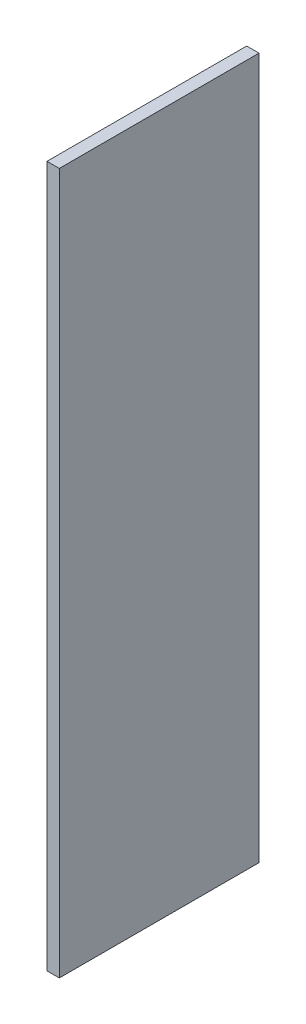
ISO-10303-21;
HEADER;
FILE_DESCRIPTION(('STEP AP214'),'2;1');
FILE_NAME('part.step','',(''),(''),'','','');
FILE_SCHEMA(('AUTOMOTIVE_DESIGN { 1 0 10303 214 1 1 1 1 }'));
ENDSEC;
DATA;
#1=APPLICATION_CONTEXT('core data for automotive mechanical design processes');
#2=APPLICATION_PROTOCOL_DEFINITION('international standard','automotive_design',2000,#1);
#3=PRODUCT_CONTEXT('',#1,'mechanical');
#4=PRODUCT('Part','Part','',(#3));
#5=PRODUCT_RELATED_PRODUCT_CATEGORY('part','',(#4));
#6=PRODUCT_DEFINITION_FORMATION('','',#4);
#7=PRODUCT_DEFINITION_CONTEXT('part definition',#1,'design');
#8=PRODUCT_DEFINITION('design','',#6,#7);
#9=PRODUCT_DEFINITION_SHAPE('','',#8);
#10=(LENGTH_UNIT() NAMED_UNIT(*) SI_UNIT(.MILLI.,.METRE.));
#11=(NAMED_UNIT(*) PLANE_ANGLE_UNIT() SI_UNIT($,.RADIAN.));
#12=(NAMED_UNIT(*) SI_UNIT($,.STERADIAN.) SOLID_ANGLE_UNIT());
#13=UNCERTAINTY_MEASURE_WITH_UNIT(LENGTH_MEASURE(1.E-05),#10,'distance_accuracy_value','');
#14=(GEOMETRIC_REPRESENTATION_CONTEXT(3) GLOBAL_UNCERTAINTY_ASSIGNED_CONTEXT((#13)) GLOBAL_UNIT_ASSIGNED_CONTEXT((#10,
#11,#12)) REPRESENTATION_CONTEXT('',''));
#15=CARTESIAN_POINT('',(0.,0.,0.));
#16=DIRECTION('',(0.,0.,1.));
#17=DIRECTION('',(1.,0.,0.));
#18=AXIS2_PLACEMENT_3D('',#15,#16,#17);
#19=CARTESIAN_POINT('',(18.,-967.219556499024,267.607933188847));
#20=DIRECTION('',(0.,0.,-1.));
#21=DIRECTION('',(-1.,0.,0.));
#22=AXIS2_PLACEMENT_3D('',#19,#20,#21);
#23=PLANE('',#22);
#24=DIRECTION('',(0.,-1.,0.));
#25=VECTOR('',#24,1.);
#26=CARTESIAN_POINT('',(0.,-967.219556499024,267.607933188847));
#27=LINE('',#26,#25);
#28=CARTESIAN_POINT('',(0.,57.7804435009756,267.607933188847));
#29=VERTEX_POINT('',#28);
#30=CARTESIAN_POINT('',(0.,-967.219556499024,267.607933188847));
#31=VERTEX_POINT('',#30);
#32=EDGE_CURVE('E96',#29,#31,#27,.T.);
#33=ORIENTED_EDGE('',*,*,#32,.T.);
#34=DIRECTION('',(-1.,0.,0.));
#35=VECTOR('',#34,1.);
#36=CARTESIAN_POINT('',(18.,-967.219556499024,267.607933188847));
#37=LINE('',#36,#35);
#38=CARTESIAN_POINT('',(18.,-967.219556499024,267.607933188847));
#39=VERTEX_POINT('',#38);
#40=EDGE_CURVE('E11',#39,#31,#37,.T.);
#41=ORIENTED_EDGE('',*,*,#40,.F.);
#42=DIRECTION('',(0.,-1.,0.));
#43=VECTOR('',#42,1.);
#44=CARTESIAN_POINT('',(18.,-967.219556499024,267.607933188847));
#45=LINE('',#44,#43);
#46=CARTESIAN_POINT('',(18.,57.7804435009756,267.607933188847));
#47=VERTEX_POINT('',#46);
#48=EDGE_CURVE('E84',#47,#39,#45,.T.);
#49=ORIENTED_EDGE('',*,*,#48,.F.);
#50=DIRECTION('',(-1.,0.,0.));
#51=VECTOR('',#50,1.);
#52=CARTESIAN_POINT('',(18.,57.7804435009756,267.607933188847));
#53=LINE('',#52,#51);
#54=EDGE_CURVE('E92',#47,#29,#53,.T.);
#55=ORIENTED_EDGE('',*,*,#54,.T.);
#56=EDGE_LOOP('',(#33,#41,#49,#55));
#57=FACE_BOUND('',#56,.T.);
#58=ADVANCED_FACE('F33',(#57),#23,.F.);
#59=CARTESIAN_POINT('',(18.,-967.219556499024,-24.392066811153));
#60=DIRECTION('',(0.,1.,0.));
#61=DIRECTION('',(0.,0.,1.));
#62=AXIS2_PLACEMENT_3D('',#59,#60,#61);
#63=PLANE('',#62);
#64=DIRECTION('',(0.,0.,-1.));
#65=VECTOR('',#64,1.);
#66=CARTESIAN_POINT('',(0.,-967.219556499024,-24.392066811153));
#67=LINE('',#66,#65);
#68=CARTESIAN_POINT('',(0.,-967.219556499024,-24.392066811153));
#69=VERTEX_POINT('',#68);
#70=EDGE_CURVE('E88',#31,#69,#67,.T.);
#71=ORIENTED_EDGE('',*,*,#70,.T.);
#72=DIRECTION('',(-1.,0.,0.));
#73=VECTOR('',#72,1.);
#74=CARTESIAN_POINT('',(18.,-967.219556499024,-24.392066811153));
#75=LINE('',#74,#73);
#76=CARTESIAN_POINT('',(18.,-967.219556499024,-24.392066811153));
#77=VERTEX_POINT('',#76);
#78=EDGE_CURVE('E41',#77,#69,#75,.T.);
#79=ORIENTED_EDGE('',*,*,#78,.F.);
#80=DIRECTION('',(0.,0.,-1.));
#81=VECTOR('',#80,1.);
#82=CARTESIAN_POINT('',(18.,-967.219556499024,-24.392066811153));
#83=LINE('',#82,#81);
#84=EDGE_CURVE('E79',#39,#77,#83,.T.);
#85=ORIENTED_EDGE('',*,*,#84,.F.);
#86=ORIENTED_EDGE('',*,*,#40,.T.);
#87=EDGE_LOOP('',(#71,#79,#85,#86));
#88=FACE_BOUND('',#87,.T.);
#89=ADVANCED_FACE('F87',(#88),#63,.F.);
#90=CARTESIAN_POINT('',(18.,-967.219556499024,-24.392066811153));
#91=DIRECTION('',(0.,0.,1.));
#92=DIRECTION('',(1.,0.,0.));
#93=AXIS2_PLACEMENT_3D('',#90,#91,#92);
#94=PLANE('',#93);
#95=DIRECTION('',(0.,1.,0.));
#96=VECTOR('',#95,1.);
#97=CARTESIAN_POINT('',(0.,-967.219556499024,-24.392066811153));
#98=LINE('',#97,#96);
#99=CARTESIAN_POINT('',(0.,57.7804435009756,-24.392066811153));
#100=VERTEX_POINT('',#99);
#101=EDGE_CURVE('E66',#69,#100,#98,.T.);
#102=ORIENTED_EDGE('',*,*,#101,.T.);
#103=DIRECTION('',(-1.,0.,0.));
#104=VECTOR('',#103,1.);
#105=CARTESIAN_POINT('',(18.,57.7804435009756,-24.392066811153));
#106=LINE('',#105,#104);
#107=CARTESIAN_POINT('',(18.,57.7804435009756,-24.392066811153));
#108=VERTEX_POINT('',#107);
#109=EDGE_CURVE('E89',#108,#100,#106,.T.);
#110=ORIENTED_EDGE('',*,*,#109,.F.);
#111=DIRECTION('',(0.,1.,0.));
#112=VECTOR('',#111,1.);
#113=CARTESIAN_POINT('',(18.,-967.219556499024,-24.392066811153));
#114=LINE('',#113,#112);
#115=EDGE_CURVE('E82',#77,#108,#114,.T.);
#116=ORIENTED_EDGE('',*,*,#115,.F.);
#117=ORIENTED_EDGE('',*,*,#78,.T.);
#118=EDGE_LOOP('',(#102,#110,#116,#117));
#119=FACE_BOUND('',#118,.T.);
#120=ADVANCED_FACE('F90',(#119),#94,.F.);
#121=CARTESIAN_POINT('',(18.,57.7804435009756,-24.392066811153));
#122=DIRECTION('',(0.,-1.,0.));
#123=DIRECTION('',(0.,0.,-1.));
#124=AXIS2_PLACEMENT_3D('',#121,#122,#123);
#125=PLANE('',#124);
#126=DIRECTION('',(0.,0.,1.));
#127=VECTOR('',#126,1.);
#128=CARTESIAN_POINT('',(0.,57.7804435009756,-24.392066811153));
#129=LINE('',#128,#127);
#130=EDGE_CURVE('E72',#100,#29,#129,.T.);
#131=ORIENTED_EDGE('',*,*,#130,.T.);
#132=ORIENTED_EDGE('',*,*,#54,.F.);
#133=DIRECTION('',(0.,0.,1.));
#134=VECTOR('',#133,1.);
#135=CARTESIAN_POINT('',(18.,57.7804435009756,-24.392066811153));
#136=LINE('',#135,#134);
#137=EDGE_CURVE('E49',#108,#47,#136,.T.);
#138=ORIENTED_EDGE('',*,*,#137,.F.);
#139=ORIENTED_EDGE('',*,*,#109,.T.);
#140=EDGE_LOOP('',(#131,#132,#138,#139));
#141=FACE_BOUND('',#140,.T.);
#142=ADVANCED_FACE('F103',(#141),#125,.F.);
#143=CARTESIAN_POINT('',(18.,0.,0.));
#144=DIRECTION('',(1.,0.,0.));
#145=DIRECTION('',(0.,0.,-1.));
#146=AXIS2_PLACEMENT_3D('',#143,#144,#145);
#147=PLANE('',#146);
#148=ORIENTED_EDGE('',*,*,#48,.T.);
#149=ORIENTED_EDGE('',*,*,#84,.T.);
#150=ORIENTED_EDGE('',*,*,#115,.T.);
#151=ORIENTED_EDGE('',*,*,#137,.T.);
#152=EDGE_LOOP('',(#148,#149,#150,#151));
#153=FACE_BOUND('',#152,.T.);
#154=ADVANCED_FACE('F80',(#153),#147,.T.);
#155=CARTESIAN_POINT('',(0.,0.,0.));
#156=DIRECTION('',(1.,0.,0.));
#157=DIRECTION('',(0.,0.,-1.));
#158=AXIS2_PLACEMENT_3D('',#155,#156,#157);
#159=PLANE('',#158);
#160=ORIENTED_EDGE('',*,*,#32,.F.);
#161=ORIENTED_EDGE('',*,*,#130,.F.);
#162=ORIENTED_EDGE('',*,*,#101,.F.);
#163=ORIENTED_EDGE('',*,*,#70,.F.);
#164=EDGE_LOOP('',(#160,#161,#162,#163));
#165=FACE_BOUND('',#164,.T.);
#166=ADVANCED_FACE('F106',(#165),#159,.F.);
#167=CLOSED_SHELL('',(#58,#89,#120,#142,#154,#166));
#168=MANIFOLD_SOLID_BREP('B2',#167);
#169=ADVANCED_BREP_SHAPE_REPRESENTATION('',(#18,#168),#14);
#170=SHAPE_DEFINITION_REPRESENTATION(#9,#169);
ENDSEC;
END-ISO-10303-21;
